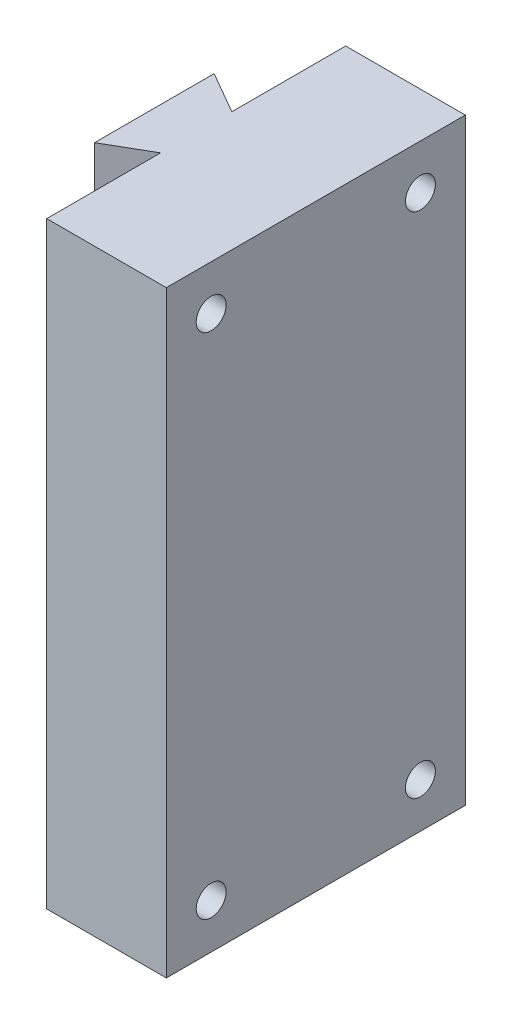
ISO-10303-21;
HEADER;
FILE_DESCRIPTION(('STEP AP214'),'2;1');
FILE_NAME('part.step','',(''),(''),'','','');
FILE_SCHEMA(('AUTOMOTIVE_DESIGN { 1 0 10303 214 1 1 1 1 }'));
ENDSEC;
DATA;
#1=APPLICATION_CONTEXT('core data for automotive mechanical design processes');
#2=APPLICATION_PROTOCOL_DEFINITION('international standard','automotive_design',2000,#1);
#3=PRODUCT_CONTEXT('',#1,'mechanical');
#4=PRODUCT('Part','Part','',(#3));
#5=PRODUCT_RELATED_PRODUCT_CATEGORY('part','',(#4));
#6=PRODUCT_DEFINITION_FORMATION('','',#4);
#7=PRODUCT_DEFINITION_CONTEXT('part definition',#1,'design');
#8=PRODUCT_DEFINITION('design','',#6,#7);
#9=PRODUCT_DEFINITION_SHAPE('','',#8);
#10=(LENGTH_UNIT() NAMED_UNIT(*) SI_UNIT(.MILLI.,.METRE.));
#11=(NAMED_UNIT(*) PLANE_ANGLE_UNIT() SI_UNIT($,.RADIAN.));
#12=(NAMED_UNIT(*) SI_UNIT($,.STERADIAN.) SOLID_ANGLE_UNIT());
#13=UNCERTAINTY_MEASURE_WITH_UNIT(LENGTH_MEASURE(1.E-05),#10,'distance_accuracy_value','');
#14=(GEOMETRIC_REPRESENTATION_CONTEXT(3) GLOBAL_UNCERTAINTY_ASSIGNED_CONTEXT((#13)) GLOBAL_UNIT_ASSIGNED_CONTEXT((#10,
#11,#12)) REPRESENTATION_CONTEXT('',''));
#15=CARTESIAN_POINT('',(0.,0.,0.));
#16=DIRECTION('',(0.,0.,1.));
#17=DIRECTION('',(1.,0.,0.));
#18=AXIS2_PLACEMENT_3D('',#15,#16,#17);
#19=CARTESIAN_POINT('',(-20.,100.,-5.95854811567258));
#20=DIRECTION('',(-0.500000000000004,0.,0.866025403784436));
#21=DIRECTION('',(0.866025403784437,0.,0.500000000000004));
#22=AXIS2_PLACEMENT_3D('',#19,#20,#21);
#23=PLANE('',#22);
#24=DIRECTION('',(-0.866025403784436,0.,-0.500000000000004));
#25=VECTOR('',#24,1.);
#26=CARTESIAN_POINT('',(-20.,0.,-5.95854811567258));
#27=LINE('',#26,#25);
#28=CARTESIAN_POINT('',(-20.,0.,-5.95854811567258));
#29=VERTEX_POINT('',#28);
#30=CARTESIAN_POINT('',(-27.,0.,-10.));
#31=VERTEX_POINT('',#30);
#32=EDGE_CURVE('E137',#29,#31,#27,.T.);
#33=ORIENTED_EDGE('',*,*,#32,.T.);
#34=DIRECTION('',(0.,-1.,0.));
#35=VECTOR('',#34,1.);
#36=CARTESIAN_POINT('',(-27.,100.,-10.));
#37=LINE('',#36,#35);
#38=CARTESIAN_POINT('',(-27.,100.,-10.));
#39=VERTEX_POINT('',#38);
#40=EDGE_CURVE('E11',#39,#31,#37,.T.);
#41=ORIENTED_EDGE('',*,*,#40,.F.);
#42=DIRECTION('',(-0.866025403784436,0.,-0.500000000000004));
#43=VECTOR('',#42,1.);
#44=CARTESIAN_POINT('',(-20.,100.,-5.95854811567258));
#45=LINE('',#44,#43);
#46=CARTESIAN_POINT('',(-20.,100.,-5.95854811567258));
#47=VERTEX_POINT('',#46);
#48=EDGE_CURVE('E152',#47,#39,#45,.T.);
#49=ORIENTED_EDGE('',*,*,#48,.F.);
#50=DIRECTION('',(0.,-1.,0.));
#51=VECTOR('',#50,1.);
#52=CARTESIAN_POINT('',(-20.,100.,-5.95854811567258));
#53=LINE('',#52,#51);
#54=EDGE_CURVE('E133',#47,#29,#53,.T.);
#55=ORIENTED_EDGE('',*,*,#54,.T.);
#56=EDGE_LOOP('',(#33,#41,#49,#55));
#57=FACE_BOUND('',#56,.T.);
#58=ADVANCED_FACE('F41',(#57),#23,.F.);
#59=CARTESIAN_POINT('',(-27.,100.,-10.));
#60=DIRECTION('',(1.,0.,0.));
#61=DIRECTION('',(0.,0.,-1.));
#62=AXIS2_PLACEMENT_3D('',#59,#60,#61);
#63=PLANE('',#62);
#64=DIRECTION('',(0.,0.,1.));
#65=VECTOR('',#64,1.);
#66=CARTESIAN_POINT('',(-27.,0.,-10.));
#67=LINE('',#66,#65);
#68=CARTESIAN_POINT('',(-27.,0.,10.));
#69=VERTEX_POINT('',#68);
#70=EDGE_CURVE('E140',#31,#69,#67,.T.);
#71=ORIENTED_EDGE('',*,*,#70,.T.);
#72=DIRECTION('',(0.,-1.,0.));
#73=VECTOR('',#72,1.);
#74=CARTESIAN_POINT('',(-27.,100.,10.));
#75=LINE('',#74,#73);
#76=CARTESIAN_POINT('',(-27.,100.,10.));
#77=VERTEX_POINT('',#76);
#78=EDGE_CURVE('E49',#77,#69,#75,.T.);
#79=ORIENTED_EDGE('',*,*,#78,.F.);
#80=DIRECTION('',(0.,0.,1.));
#81=VECTOR('',#80,1.);
#82=CARTESIAN_POINT('',(-27.,100.,-10.));
#83=LINE('',#82,#81);
#84=EDGE_CURVE('E100',#39,#77,#83,.T.);
#85=ORIENTED_EDGE('',*,*,#84,.F.);
#86=ORIENTED_EDGE('',*,*,#40,.T.);
#87=EDGE_LOOP('',(#71,#79,#85,#86));
#88=FACE_BOUND('',#87,.T.);
#89=ADVANCED_FACE('F232',(#88),#63,.F.);
#90=CARTESIAN_POINT('',(-27.,100.,10.));
#91=DIRECTION('',(-0.500000000000004,0.,-0.866025403784436));
#92=DIRECTION('',(-0.866025403784436,0.,0.500000000000004));
#93=AXIS2_PLACEMENT_3D('',#90,#91,#92);
#94=PLANE('',#93);
#95=DIRECTION('',(0.866025403784436,0.,-0.500000000000004));
#96=VECTOR('',#95,1.);
#97=CARTESIAN_POINT('',(-27.,0.,10.));
#98=LINE('',#97,#96);
#99=CARTESIAN_POINT('',(-20.,0.,5.95854811567257));
#100=VERTEX_POINT('',#99);
#101=EDGE_CURVE('E143',#69,#100,#98,.T.);
#102=ORIENTED_EDGE('',*,*,#101,.T.);
#103=DIRECTION('',(0.,-1.,0.));
#104=VECTOR('',#103,1.);
#105=CARTESIAN_POINT('',(-20.,100.,5.95854811567257));
#106=LINE('',#105,#104);
#107=CARTESIAN_POINT('',(-20.,100.,5.95854811567257));
#108=VERTEX_POINT('',#107);
#109=EDGE_CURVE('E159',#108,#100,#106,.T.);
#110=ORIENTED_EDGE('',*,*,#109,.F.);
#111=DIRECTION('',(0.866025403784436,0.,-0.500000000000004));
#112=VECTOR('',#111,1.);
#113=CARTESIAN_POINT('',(-27.,100.,10.));
#114=LINE('',#113,#112);
#115=EDGE_CURVE('E167',#77,#108,#114,.T.);
#116=ORIENTED_EDGE('',*,*,#115,.F.);
#117=ORIENTED_EDGE('',*,*,#78,.T.);
#118=EDGE_LOOP('',(#102,#110,#116,#117));
#119=FACE_BOUND('',#118,.T.);
#120=ADVANCED_FACE('F165',(#119),#94,.F.);
#121=CARTESIAN_POINT('',(-20.,100.,5.95854811567257));
#122=DIRECTION('',(1.,0.,0.));
#123=DIRECTION('',(0.,0.,-1.));
#124=AXIS2_PLACEMENT_3D('',#121,#122,#123);
#125=PLANE('',#124);
#126=DIRECTION('',(0.,0.,1.));
#127=VECTOR('',#126,1.);
#128=CARTESIAN_POINT('',(-20.,0.,5.95854811567257));
#129=LINE('',#128,#127);
#130=CARTESIAN_POINT('',(-20.,0.,25.));
#131=VERTEX_POINT('',#130);
#132=EDGE_CURVE('E145',#100,#131,#129,.T.);
#133=ORIENTED_EDGE('',*,*,#132,.T.);
#134=DIRECTION('',(0.,-1.,0.));
#135=VECTOR('',#134,1.);
#136=CARTESIAN_POINT('',(-20.,100.,25.));
#137=LINE('',#136,#135);
#138=CARTESIAN_POINT('',(-20.,100.,25.));
#139=VERTEX_POINT('',#138);
#140=EDGE_CURVE('E156',#139,#131,#137,.T.);
#141=ORIENTED_EDGE('',*,*,#140,.F.);
#142=DIRECTION('',(0.,0.,1.));
#143=VECTOR('',#142,1.);
#144=CARTESIAN_POINT('',(-20.,100.,5.95854811567257));
#145=LINE('',#144,#143);
#146=EDGE_CURVE('E179',#108,#139,#145,.T.);
#147=ORIENTED_EDGE('',*,*,#146,.F.);
#148=ORIENTED_EDGE('',*,*,#109,.T.);
#149=EDGE_LOOP('',(#133,#141,#147,#148));
#150=FACE_BOUND('',#149,.T.);
#151=ADVANCED_FACE('F175',(#150),#125,.F.);
#152=CARTESIAN_POINT('',(-20.,100.,25.));
#153=DIRECTION('',(0.,0.,-1.));
#154=DIRECTION('',(-1.,0.,0.));
#155=AXIS2_PLACEMENT_3D('',#152,#153,#154);
#156=PLANE('',#155);
#157=DIRECTION('',(1.,0.,0.));
#158=VECTOR('',#157,1.);
#159=CARTESIAN_POINT('',(-20.,0.,25.));
#160=LINE('',#159,#158);
#161=CARTESIAN_POINT('',(0.,0.,25.));
#162=VERTEX_POINT('',#161);
#163=EDGE_CURVE('E147',#131,#162,#160,.T.);
#164=ORIENTED_EDGE('',*,*,#163,.T.);
#165=DIRECTION('',(0.,-1.,0.));
#166=VECTOR('',#165,1.);
#167=CARTESIAN_POINT('',(0.,100.,25.));
#168=LINE('',#167,#166);
#169=CARTESIAN_POINT('',(0.,100.,25.));
#170=VERTEX_POINT('',#169);
#171=EDGE_CURVE('E128',#170,#162,#168,.T.);
#172=ORIENTED_EDGE('',*,*,#171,.F.);
#173=DIRECTION('',(1.,0.,0.));
#174=VECTOR('',#173,1.);
#175=CARTESIAN_POINT('',(-20.,100.,25.));
#176=LINE('',#175,#174);
#177=EDGE_CURVE('E119',#139,#170,#176,.T.);
#178=ORIENTED_EDGE('',*,*,#177,.F.);
#179=ORIENTED_EDGE('',*,*,#140,.T.);
#180=EDGE_LOOP('',(#164,#172,#178,#179));
#181=FACE_BOUND('',#180,.T.);
#182=ADVANCED_FACE('F178',(#181),#156,.F.);
#183=CARTESIAN_POINT('',(0.,100.,25.));
#184=DIRECTION('',(-1.,0.,0.));
#185=DIRECTION('',(0.,0.,1.));
#186=AXIS2_PLACEMENT_3D('',#183,#184,#185);
#187=PLANE('',#186);
#188=CARTESIAN_POINT('',(0.,92.5,-17.5));
#189=DIRECTION('',(1.,0.,0.));
#190=DIRECTION('',(0.,0.,-1.));
#191=AXIS2_PLACEMENT_3D('',#188,#189,#190);
#192=CIRCLE('',#191,2.5);
#193=CARTESIAN_POINT('',(0.,92.5,-20.));
#194=VERTEX_POINT('',#193);
#195=EDGE_CURVE('E194',#194,#194,#192,.T.);
#196=ORIENTED_EDGE('',*,*,#195,.F.);
#197=EDGE_LOOP('',(#196));
#198=FACE_BOUND('',#197,.T.);
#199=CARTESIAN_POINT('',(0.,7.49999999999999,-17.5));
#200=DIRECTION('',(1.,0.,0.));
#201=DIRECTION('',(0.,0.,-1.));
#202=AXIS2_PLACEMENT_3D('',#199,#200,#201);
#203=CIRCLE('',#202,2.5);
#204=CARTESIAN_POINT('',(0.,7.49999999999999,-20.));
#205=VERTEX_POINT('',#204);
#206=EDGE_CURVE('E200',#205,#205,#203,.T.);
#207=ORIENTED_EDGE('',*,*,#206,.F.);
#208=EDGE_LOOP('',(#207));
#209=FACE_BOUND('',#208,.T.);
#210=CARTESIAN_POINT('',(0.,7.49999999999999,17.5));
#211=DIRECTION('',(1.,0.,0.));
#212=DIRECTION('',(0.,0.,-1.));
#213=AXIS2_PLACEMENT_3D('',#210,#211,#212);
#214=CIRCLE('',#213,2.5);
#215=CARTESIAN_POINT('',(0.,7.49999999999999,15.));
#216=VERTEX_POINT('',#215);
#217=EDGE_CURVE('E188',#216,#216,#214,.T.);
#218=ORIENTED_EDGE('',*,*,#217,.F.);
#219=EDGE_LOOP('',(#218));
#220=FACE_BOUND('',#219,.T.);
#221=CARTESIAN_POINT('',(0.,92.5,17.5));
#222=DIRECTION('',(1.,0.,0.));
#223=DIRECTION('',(0.,0.,-1.));
#224=AXIS2_PLACEMENT_3D('',#221,#222,#223);
#225=CIRCLE('',#224,2.5);
#226=CARTESIAN_POINT('',(0.,92.5,15.));
#227=VERTEX_POINT('',#226);
#228=EDGE_CURVE('E185',#227,#227,#225,.T.);
#229=ORIENTED_EDGE('',*,*,#228,.F.);
#230=EDGE_LOOP('',(#229));
#231=FACE_BOUND('',#230,.T.);
#232=DIRECTION('',(0.,0.,-1.));
#233=VECTOR('',#232,1.);
#234=CARTESIAN_POINT('',(0.,0.,25.));
#235=LINE('',#234,#233);
#236=CARTESIAN_POINT('',(0.,0.,-25.));
#237=VERTEX_POINT('',#236);
#238=EDGE_CURVE('E127',#162,#237,#235,.T.);
#239=ORIENTED_EDGE('',*,*,#238,.T.);
#240=DIRECTION('',(0.,-1.,0.));
#241=VECTOR('',#240,1.);
#242=CARTESIAN_POINT('',(0.,100.,-25.));
#243=LINE('',#242,#241);
#244=CARTESIAN_POINT('',(0.,100.,-25.));
#245=VERTEX_POINT('',#244);
#246=EDGE_CURVE('E124',#245,#237,#243,.T.);
#247=ORIENTED_EDGE('',*,*,#246,.F.);
#248=DIRECTION('',(0.,0.,-1.));
#249=VECTOR('',#248,1.);
#250=CARTESIAN_POINT('',(0.,100.,25.));
#251=LINE('',#250,#249);
#252=EDGE_CURVE('E113',#170,#245,#251,.T.);
#253=ORIENTED_EDGE('',*,*,#252,.F.);
#254=ORIENTED_EDGE('',*,*,#171,.T.);
#255=EDGE_LOOP('',(#239,#247,#253,#254));
#256=FACE_BOUND('',#255,.T.);
#257=ADVANCED_FACE('F125',(#198,#209,#220,#231,#256),#187,.F.);
#258=CARTESIAN_POINT('',(0.,100.,-25.));
#259=DIRECTION('',(0.,0.,1.));
#260=DIRECTION('',(1.,0.,0.));
#261=AXIS2_PLACEMENT_3D('',#258,#259,#260);
#262=PLANE('',#261);
#263=DIRECTION('',(-1.,0.,0.));
#264=VECTOR('',#263,1.);
#265=CARTESIAN_POINT('',(0.,0.,-25.));
#266=LINE('',#265,#264);
#267=CARTESIAN_POINT('',(-20.,0.,-25.));
#268=VERTEX_POINT('',#267);
#269=EDGE_CURVE('E86',#237,#268,#266,.T.);
#270=ORIENTED_EDGE('',*,*,#269,.T.);
#271=DIRECTION('',(0.,-1.,0.));
#272=VECTOR('',#271,1.);
#273=CARTESIAN_POINT('',(-20.,100.,-25.));
#274=LINE('',#273,#272);
#275=CARTESIAN_POINT('',(-20.,100.,-25.));
#276=VERTEX_POINT('',#275);
#277=EDGE_CURVE('E129',#276,#268,#274,.T.);
#278=ORIENTED_EDGE('',*,*,#277,.F.);
#279=DIRECTION('',(-1.,0.,0.));
#280=VECTOR('',#279,1.);
#281=CARTESIAN_POINT('',(0.,100.,-25.));
#282=LINE('',#281,#280);
#283=EDGE_CURVE('E117',#245,#276,#282,.T.);
#284=ORIENTED_EDGE('',*,*,#283,.F.);
#285=ORIENTED_EDGE('',*,*,#246,.T.);
#286=EDGE_LOOP('',(#270,#278,#284,#285));
#287=FACE_BOUND('',#286,.T.);
#288=ADVANCED_FACE('F131',(#287),#262,.F.);
#289=CARTESIAN_POINT('',(-20.,100.,-25.));
#290=DIRECTION('',(1.,0.,0.));
#291=DIRECTION('',(0.,0.,-1.));
#292=AXIS2_PLACEMENT_3D('',#289,#290,#291);
#293=PLANE('',#292);
#294=DIRECTION('',(0.,0.,1.));
#295=VECTOR('',#294,1.);
#296=CARTESIAN_POINT('',(-20.,0.,-25.));
#297=LINE('',#296,#295);
#298=EDGE_CURVE('E92',#268,#29,#297,.T.);
#299=ORIENTED_EDGE('',*,*,#298,.T.);
#300=ORIENTED_EDGE('',*,*,#54,.F.);
#301=DIRECTION('',(0.,0.,1.));
#302=VECTOR('',#301,1.);
#303=CARTESIAN_POINT('',(-20.,100.,-25.));
#304=LINE('',#303,#302);
#305=EDGE_CURVE('E57',#276,#47,#304,.T.);
#306=ORIENTED_EDGE('',*,*,#305,.F.);
#307=ORIENTED_EDGE('',*,*,#277,.T.);
#308=EDGE_LOOP('',(#299,#300,#306,#307));
#309=FACE_BOUND('',#308,.T.);
#310=ADVANCED_FACE('F239',(#309),#293,.F.);
#311=CARTESIAN_POINT('',(0.,100.,0.));
#312=DIRECTION('',(0.,1.,0.));
#313=DIRECTION('',(0.,0.,1.));
#314=AXIS2_PLACEMENT_3D('',#311,#312,#313);
#315=PLANE('',#314);
#316=ORIENTED_EDGE('',*,*,#48,.T.);
#317=ORIENTED_EDGE('',*,*,#84,.T.);
#318=ORIENTED_EDGE('',*,*,#115,.T.);
#319=ORIENTED_EDGE('',*,*,#146,.T.);
#320=ORIENTED_EDGE('',*,*,#177,.T.);
#321=ORIENTED_EDGE('',*,*,#252,.T.);
#322=ORIENTED_EDGE('',*,*,#283,.T.);
#323=ORIENTED_EDGE('',*,*,#305,.T.);
#324=EDGE_LOOP('',(#316,#317,#318,#319,#320,#321,#322,#323));
#325=FACE_BOUND('',#324,.T.);
#326=ADVANCED_FACE('F115',(#325),#315,.T.);
#327=CARTESIAN_POINT('',(0.,0.,0.));
#328=DIRECTION('',(0.,1.,0.));
#329=DIRECTION('',(0.,0.,1.));
#330=AXIS2_PLACEMENT_3D('',#327,#328,#329);
#331=PLANE('',#330);
#332=ORIENTED_EDGE('',*,*,#32,.F.);
#333=ORIENTED_EDGE('',*,*,#298,.F.);
#334=ORIENTED_EDGE('',*,*,#269,.F.);
#335=ORIENTED_EDGE('',*,*,#238,.F.);
#336=ORIENTED_EDGE('',*,*,#163,.F.);
#337=ORIENTED_EDGE('',*,*,#132,.F.);
#338=ORIENTED_EDGE('',*,*,#101,.F.);
#339=ORIENTED_EDGE('',*,*,#70,.F.);
#340=EDGE_LOOP('',(#332,#333,#334,#335,#336,#337,#338,#339));
#341=FACE_BOUND('',#340,.T.);
#342=ADVANCED_FACE('F171',(#341),#331,.F.);
#343=CARTESIAN_POINT('',(-10.,92.5,17.5));
#344=DIRECTION('',(1.,0.,0.));
#345=DIRECTION('',(0.,0.,-1.));
#346=AXIS2_PLACEMENT_3D('',#343,#344,#345);
#347=CYLINDRICAL_SURFACE('',#346,2.5);
#348=CARTESIAN_POINT('',(-10.,92.5,17.5));
#349=DIRECTION('',(1.,0.,0.));
#350=DIRECTION('',(0.,0.,-1.));
#351=AXIS2_PLACEMENT_3D('',#348,#349,#350);
#352=CIRCLE('',#351,2.5);
#353=CARTESIAN_POINT('',(-10.,92.5,15.));
#354=VERTEX_POINT('',#353);
#355=EDGE_CURVE('E141',#354,#354,#352,.T.);
#356=ORIENTED_EDGE('',*,*,#355,.F.);
#357=EDGE_LOOP('',(#356));
#358=FACE_BOUND('',#357,.T.);
#359=ORIENTED_EDGE('',*,*,#228,.T.);
#360=EDGE_LOOP('',(#359));
#361=FACE_BOUND('',#360,.T.);
#362=ADVANCED_FACE('F217',(#358,#361),#347,.F.);
#363=CARTESIAN_POINT('',(-10.,92.5,17.5));
#364=DIRECTION('',(1.,0.,0.));
#365=DIRECTION('',(0.,0.,-1.));
#366=AXIS2_PLACEMENT_3D('',#363,#364,#365);
#367=PLANE('',#366);
#368=ORIENTED_EDGE('',*,*,#355,.T.);
#369=EDGE_LOOP('',(#368));
#370=FACE_BOUND('',#369,.T.);
#371=ADVANCED_FACE('F219',(#370),#367,.T.);
#372=CARTESIAN_POINT('',(-10.,7.49999999999999,17.5));
#373=DIRECTION('',(1.,0.,0.));
#374=DIRECTION('',(0.,0.,-1.));
#375=AXIS2_PLACEMENT_3D('',#372,#373,#374);
#376=CYLINDRICAL_SURFACE('',#375,2.5);
#377=CARTESIAN_POINT('',(-10.,7.49999999999999,17.5));
#378=DIRECTION('',(1.,0.,0.));
#379=DIRECTION('',(0.,0.,-1.));
#380=AXIS2_PLACEMENT_3D('',#377,#378,#379);
#381=CIRCLE('',#380,2.5);
#382=CARTESIAN_POINT('',(-10.,7.49999999999999,15.));
#383=VERTEX_POINT('',#382);
#384=EDGE_CURVE('E203',#383,#383,#381,.T.);
#385=ORIENTED_EDGE('',*,*,#384,.F.);
#386=EDGE_LOOP('',(#385));
#387=FACE_BOUND('',#386,.T.);
#388=ORIENTED_EDGE('',*,*,#217,.T.);
#389=EDGE_LOOP('',(#388));
#390=FACE_BOUND('',#389,.T.);
#391=ADVANCED_FACE('F209',(#387,#390),#376,.F.);
#392=CARTESIAN_POINT('',(-10.,7.49999999999999,17.5));
#393=DIRECTION('',(1.,0.,0.));
#394=DIRECTION('',(0.,0.,-1.));
#395=AXIS2_PLACEMENT_3D('',#392,#393,#394);
#396=PLANE('',#395);
#397=ORIENTED_EDGE('',*,*,#384,.T.);
#398=EDGE_LOOP('',(#397));
#399=FACE_BOUND('',#398,.T.);
#400=ADVANCED_FACE('F318',(#399),#396,.T.);
#401=CARTESIAN_POINT('',(-10.,7.49999999999999,-17.5));
#402=DIRECTION('',(1.,0.,0.));
#403=DIRECTION('',(0.,0.,-1.));
#404=AXIS2_PLACEMENT_3D('',#401,#402,#403);
#405=CYLINDRICAL_SURFACE('',#404,2.5);
#406=CARTESIAN_POINT('',(-10.,7.49999999999999,-17.5));
#407=DIRECTION('',(1.,0.,0.));
#408=DIRECTION('',(0.,0.,-1.));
#409=AXIS2_PLACEMENT_3D('',#406,#407,#408);
#410=CIRCLE('',#409,2.5);
#411=CARTESIAN_POINT('',(-10.,7.49999999999999,-20.));
#412=VERTEX_POINT('',#411);
#413=EDGE_CURVE('E197',#412,#412,#410,.T.);
#414=ORIENTED_EDGE('',*,*,#413,.F.);
#415=EDGE_LOOP('',(#414));
#416=FACE_BOUND('',#415,.T.);
#417=ORIENTED_EDGE('',*,*,#206,.T.);
#418=EDGE_LOOP('',(#417));
#419=FACE_BOUND('',#418,.T.);
#420=ADVANCED_FACE('F329',(#416,#419),#405,.F.);
#421=CARTESIAN_POINT('',(-10.,7.49999999999999,-17.5));
#422=DIRECTION('',(1.,0.,0.));
#423=DIRECTION('',(0.,0.,-1.));
#424=AXIS2_PLACEMENT_3D('',#421,#422,#423);
#425=PLANE('',#424);
#426=ORIENTED_EDGE('',*,*,#413,.T.);
#427=EDGE_LOOP('',(#426));
#428=FACE_BOUND('',#427,.T.);
#429=ADVANCED_FACE('F340',(#428),#425,.T.);
#430=CARTESIAN_POINT('',(-10.,92.5,-17.5));
#431=DIRECTION('',(1.,0.,0.));
#432=DIRECTION('',(0.,0.,-1.));
#433=AXIS2_PLACEMENT_3D('',#430,#431,#432);
#434=CYLINDRICAL_SURFACE('',#433,2.5);
#435=CARTESIAN_POINT('',(-10.,92.5,-17.5));
#436=DIRECTION('',(1.,0.,0.));
#437=DIRECTION('',(0.,0.,-1.));
#438=AXIS2_PLACEMENT_3D('',#435,#436,#437);
#439=CIRCLE('',#438,2.5);
#440=CARTESIAN_POINT('',(-10.,92.5,-20.));
#441=VERTEX_POINT('',#440);
#442=EDGE_CURVE('E191',#441,#441,#439,.T.);
#443=ORIENTED_EDGE('',*,*,#442,.F.);
#444=EDGE_LOOP('',(#443));
#445=FACE_BOUND('',#444,.T.);
#446=ORIENTED_EDGE('',*,*,#195,.T.);
#447=EDGE_LOOP('',(#446));
#448=FACE_BOUND('',#447,.T.);
#449=ADVANCED_FACE('F351',(#445,#448),#434,.F.);
#450=CARTESIAN_POINT('',(-10.,92.5,-17.5));
#451=DIRECTION('',(1.,0.,0.));
#452=DIRECTION('',(0.,0.,-1.));
#453=AXIS2_PLACEMENT_3D('',#450,#451,#452);
#454=PLANE('',#453);
#455=ORIENTED_EDGE('',*,*,#442,.T.);
#456=EDGE_LOOP('',(#455));
#457=FACE_BOUND('',#456,.T.);
#458=ADVANCED_FACE('F362',(#457),#454,.T.);
#459=CLOSED_SHELL('',(#58,#89,#120,#151,#182,#257,#288,#310,#326,#342,#362,#371,#391,#400,#420,
#429,#449,#458));
#460=MANIFOLD_SOLID_BREP('B2',#459);
#461=ADVANCED_BREP_SHAPE_REPRESENTATION('',(#18,#460),#14);
#462=SHAPE_DEFINITION_REPRESENTATION(#9,#461);
ENDSEC;
END-ISO-10303-21;
